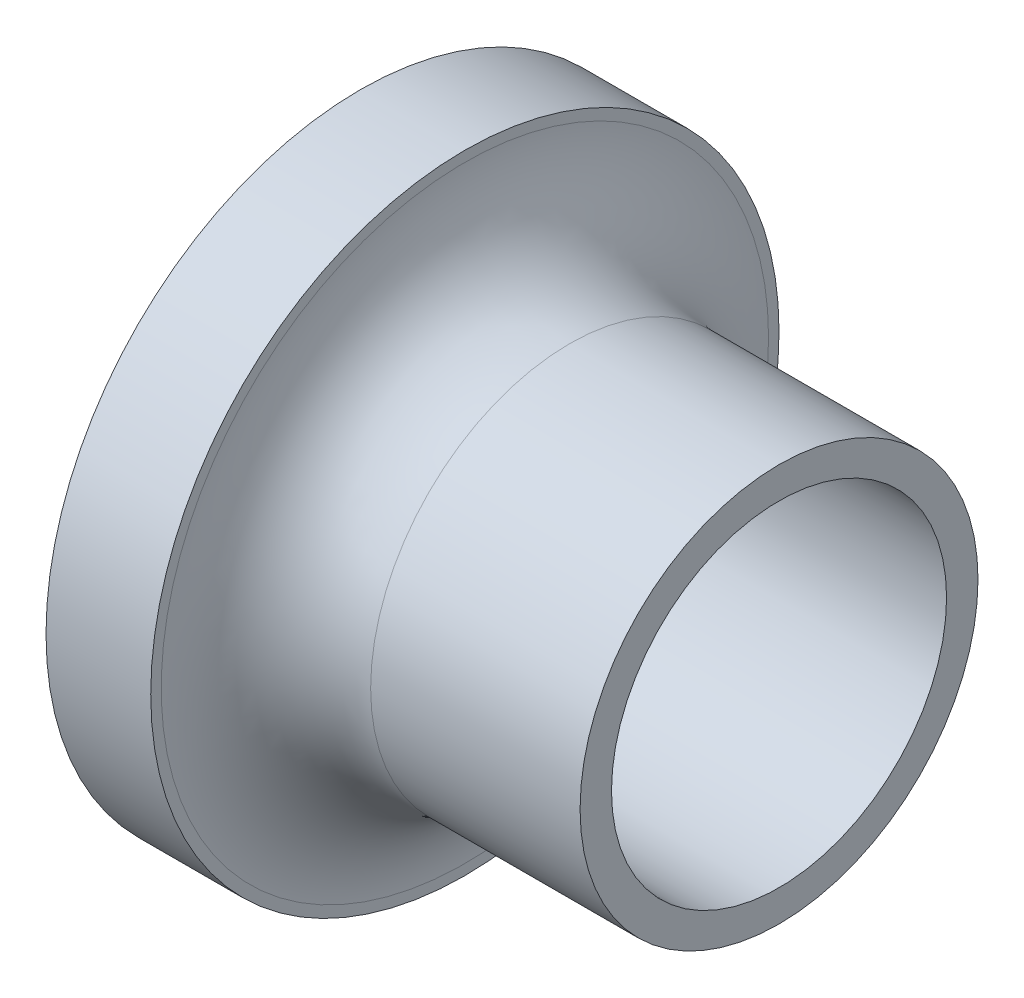
ISO-10303-21;
HEADER;
FILE_DESCRIPTION(('STEP AP214'),'2;1');
FILE_NAME('part.step','',(''),(''),'','','');
FILE_SCHEMA(('AUTOMOTIVE_DESIGN { 1 0 10303 214 1 1 1 1 }'));
ENDSEC;
DATA;
#1=APPLICATION_CONTEXT('core data for automotive mechanical design processes');
#2=APPLICATION_PROTOCOL_DEFINITION('international standard','automotive_design',2000,#1);
#3=PRODUCT_CONTEXT('',#1,'mechanical');
#4=PRODUCT('Part','Part','',(#3));
#5=PRODUCT_RELATED_PRODUCT_CATEGORY('part','',(#4));
#6=PRODUCT_DEFINITION_FORMATION('','',#4);
#7=PRODUCT_DEFINITION_CONTEXT('part definition',#1,'design');
#8=PRODUCT_DEFINITION('design','',#6,#7);
#9=PRODUCT_DEFINITION_SHAPE('','',#8);
#10=(LENGTH_UNIT() NAMED_UNIT(*) SI_UNIT(.MILLI.,.METRE.));
#11=(NAMED_UNIT(*) PLANE_ANGLE_UNIT() SI_UNIT($,.RADIAN.));
#12=(NAMED_UNIT(*) SI_UNIT($,.STERADIAN.) SOLID_ANGLE_UNIT());
#13=UNCERTAINTY_MEASURE_WITH_UNIT(LENGTH_MEASURE(1.E-05),#10,'distance_accuracy_value','');
#14=(GEOMETRIC_REPRESENTATION_CONTEXT(3) GLOBAL_UNCERTAINTY_ASSIGNED_CONTEXT((#13)) GLOBAL_UNIT_ASSIGNED_CONTEXT((#10,
#11,#12)) REPRESENTATION_CONTEXT('',''));
#15=CARTESIAN_POINT('',(0.,0.,0.));
#16=DIRECTION('',(0.,0.,1.));
#17=DIRECTION('',(1.,0.,0.));
#18=AXIS2_PLACEMENT_3D('',#15,#16,#17);
#19=CARTESIAN_POINT('',(20.,0.,0.));
#20=DIRECTION('',(1.,0.,0.));
#21=DIRECTION('',(0.,0.,-1.));
#22=AXIS2_PLACEMENT_3D('',#19,#20,#21);
#23=PLANE('',#22);
#24=CARTESIAN_POINT('',(20.,0.,0.));
#25=DIRECTION('',(1.,0.,0.));
#26=DIRECTION('',(0.,0.,-1.));
#27=AXIS2_PLACEMENT_3D('',#24,#25,#26);
#28=CIRCLE('',#27,9.5);
#29=CARTESIAN_POINT('',(20.,0.,-9.5));
#30=VERTEX_POINT('',#29);
#31=EDGE_CURVE('E46',#30,#30,#28,.T.);
#32=ORIENTED_EDGE('',*,*,#31,.T.);
#33=EDGE_LOOP('',(#32));
#34=FACE_BOUND('',#33,.T.);
#35=CARTESIAN_POINT('',(20.,0.,0.));
#36=DIRECTION('',(1.,0.,0.));
#37=DIRECTION('',(0.,0.,-1.));
#38=AXIS2_PLACEMENT_3D('',#35,#36,#37);
#39=CIRCLE('',#38,8.);
#40=CARTESIAN_POINT('',(20.,0.,-8.));
#41=VERTEX_POINT('',#40);
#42=EDGE_CURVE('E51',#41,#41,#39,.T.);
#43=ORIENTED_EDGE('',*,*,#42,.F.);
#44=EDGE_LOOP('',(#43));
#45=FACE_BOUND('',#44,.T.);
#46=ADVANCED_FACE('F31',(#34,#45),#23,.T.);
#47=CARTESIAN_POINT('',(20.,0.,0.));
#48=DIRECTION('',(-1.,0.,0.));
#49=DIRECTION('',(0.,0.,1.));
#50=AXIS2_PLACEMENT_3D('',#47,#48,#49);
#51=CYLINDRICAL_SURFACE('',#50,9.5);
#52=CARTESIAN_POINT('',(10.,0.,0.));
#53=DIRECTION('',(1.,0.,0.));
#54=DIRECTION('',(0.,0.,-1.));
#55=AXIS2_PLACEMENT_3D('',#52,#53,#54);
#56=CIRCLE('',#55,9.5);
#57=CARTESIAN_POINT('',(10.,0.,-9.5));
#58=VERTEX_POINT('',#57);
#59=EDGE_CURVE('E38',#58,#58,#56,.T.);
#60=ORIENTED_EDGE('',*,*,#59,.T.);
#61=EDGE_LOOP('',(#60));
#62=FACE_BOUND('',#61,.T.);
#63=ORIENTED_EDGE('',*,*,#31,.F.);
#64=EDGE_LOOP('',(#63));
#65=FACE_BOUND('',#64,.T.);
#66=ADVANCED_FACE('F81',(#62,#65),#51,.T.);
#67=CARTESIAN_POINT('',(20.,0.,0.));
#68=DIRECTION('',(-1.,0.,0.));
#69=DIRECTION('',(0.,0.,1.));
#70=AXIS2_PLACEMENT_3D('',#67,#68,#69);
#71=CYLINDRICAL_SURFACE('',#70,8.);
#72=CARTESIAN_POINT('',(5.,0.,0.));
#73=DIRECTION('',(1.,0.,0.));
#74=DIRECTION('',(0.,0.,-1.));
#75=AXIS2_PLACEMENT_3D('',#72,#73,#74);
#76=CIRCLE('',#75,8.);
#77=CARTESIAN_POINT('',(5.,0.,-8.));
#78=VERTEX_POINT('',#77);
#79=EDGE_CURVE('E42',#78,#78,#76,.T.);
#80=ORIENTED_EDGE('',*,*,#79,.F.);
#81=EDGE_LOOP('',(#80));
#82=FACE_BOUND('',#81,.T.);
#83=ORIENTED_EDGE('',*,*,#42,.T.);
#84=EDGE_LOOP('',(#83));
#85=FACE_BOUND('',#84,.T.);
#86=ADVANCED_FACE('F86',(#82,#85),#71,.F.);
#87=CARTESIAN_POINT('',(5.,0.,0.));
#88=DIRECTION('',(1.,0.,0.));
#89=DIRECTION('',(0.,0.,-1.));
#90=AXIS2_PLACEMENT_3D('',#87,#88,#89);
#91=PLANE('',#90);
#92=ORIENTED_EDGE('',*,*,#79,.T.);
#93=EDGE_LOOP('',(#92));
#94=FACE_BOUND('',#93,.T.);
#95=ADVANCED_FACE('F66',(#94),#91,.T.);
#96=CARTESIAN_POINT('',(5.,0.,0.));
#97=DIRECTION('',(-1.,0.,0.));
#98=DIRECTION('',(0.,0.,1.));
#99=AXIS2_PLACEMENT_3D('',#96,#97,#98);
#100=CYLINDRICAL_SURFACE('',#99,15.);
#101=CARTESIAN_POINT('',(5.,0.,0.));
#102=DIRECTION('',(1.,0.,0.));
#103=DIRECTION('',(0.,0.,-1.));
#104=AXIS2_PLACEMENT_3D('',#101,#102,#103);
#105=CIRCLE('',#104,15.);
#106=CARTESIAN_POINT('',(5.,0.,-15.));
#107=VERTEX_POINT('',#106);
#108=EDGE_CURVE('E54',#107,#107,#105,.T.);
#109=ORIENTED_EDGE('',*,*,#108,.F.);
#110=EDGE_LOOP('',(#109));
#111=FACE_BOUND('',#110,.T.);
#112=CARTESIAN_POINT('',(0.,0.,0.));
#113=DIRECTION('',(1.,0.,0.));
#114=DIRECTION('',(0.,0.,-1.));
#115=AXIS2_PLACEMENT_3D('',#112,#113,#114);
#116=CIRCLE('',#115,15.);
#117=CARTESIAN_POINT('',(0.,0.,-15.));
#118=VERTEX_POINT('',#117);
#119=EDGE_CURVE('E55',#118,#118,#116,.T.);
#120=ORIENTED_EDGE('',*,*,#119,.T.);
#121=EDGE_LOOP('',(#120));
#122=FACE_BOUND('',#121,.T.);
#123=ADVANCED_FACE('F63',(#111,#122),#100,.T.);
#124=CARTESIAN_POINT('',(5.,0.,0.));
#125=DIRECTION('',(1.,0.,0.));
#126=DIRECTION('',(0.,0.,-1.));
#127=AXIS2_PLACEMENT_3D('',#124,#125,#126);
#128=CIRCLE('',#127,14.5);
#129=CARTESIAN_POINT('',(5.,0.,-14.5));
#130=VERTEX_POINT('',#129);
#131=EDGE_CURVE('E10',#130,#130,#128,.F.);
#132=ORIENTED_EDGE('',*,*,#131,.T.);
#133=EDGE_LOOP('',(#132));
#134=FACE_BOUND('',#133,.T.);
#135=ORIENTED_EDGE('',*,*,#108,.T.);
#136=EDGE_LOOP('',(#135));
#137=FACE_BOUND('',#136,.T.);
#138=ADVANCED_FACE('F61',(#134,#137),#91,.T.);
#139=CARTESIAN_POINT('',(0.,0.,0.));
#140=DIRECTION('',(1.,0.,0.));
#141=DIRECTION('',(0.,0.,-1.));
#142=AXIS2_PLACEMENT_3D('',#139,#140,#141);
#143=PLANE('',#142);
#144=ORIENTED_EDGE('',*,*,#119,.F.);
#145=EDGE_LOOP('',(#144));
#146=FACE_BOUND('',#145,.T.);
#147=ADVANCED_FACE('F70',(#146),#143,.F.);
#148=CARTESIAN_POINT('',(10.,0.,0.));
#149=DIRECTION('',(1.,0.,0.));
#150=DIRECTION('',(0.,0.,-1.));
#151=AXIS2_PLACEMENT_3D('',#148,#149,#150);
#152=TOROIDAL_SURFACE('',#151,14.5,5.);
#153=ORIENTED_EDGE('',*,*,#131,.F.);
#154=EDGE_LOOP('',(#153));
#155=FACE_BOUND('',#154,.T.);
#156=ORIENTED_EDGE('',*,*,#59,.F.);
#157=EDGE_LOOP('',(#156));
#158=FACE_BOUND('',#157,.T.);
#159=ADVANCED_FACE('F33',(#155,#158),#152,.F.);
#160=CLOSED_SHELL('',(#46,#66,#86,#95,#123,#138,#147,#159));
#161=MANIFOLD_SOLID_BREP('B2',#160);
#162=ADVANCED_BREP_SHAPE_REPRESENTATION('',(#18,#161),#14);
#163=SHAPE_DEFINITION_REPRESENTATION(#9,#162);
ENDSEC;
END-ISO-10303-21;
